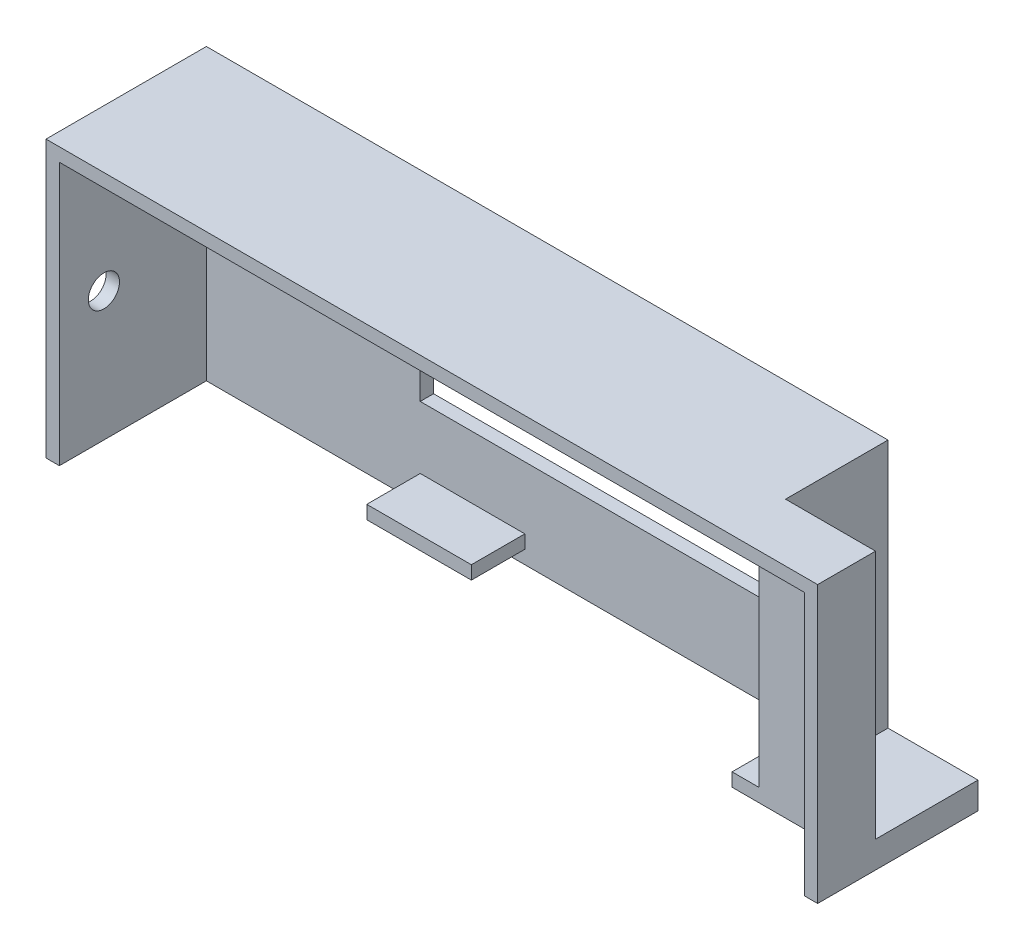
ISO-10303-21;
HEADER;
FILE_DESCRIPTION(('STEP AP214'),'2;1');
FILE_NAME('part.step','',(''),(''),'','','');
FILE_SCHEMA(('AUTOMOTIVE_DESIGN { 1 0 10303 214 1 1 1 1 }'));
ENDSEC;
DATA;
#1=APPLICATION_CONTEXT('core data for automotive mechanical design processes');
#2=APPLICATION_PROTOCOL_DEFINITION('international standard','automotive_design',2000,#1);
#3=PRODUCT_CONTEXT('',#1,'mechanical');
#4=PRODUCT('Part','Part','',(#3));
#5=PRODUCT_RELATED_PRODUCT_CATEGORY('part','',(#4));
#6=PRODUCT_DEFINITION_FORMATION('','',#4);
#7=PRODUCT_DEFINITION_CONTEXT('part definition',#1,'design');
#8=PRODUCT_DEFINITION('design','',#6,#7);
#9=PRODUCT_DEFINITION_SHAPE('','',#8);
#10=(LENGTH_UNIT() NAMED_UNIT(*) SI_UNIT(.MILLI.,.METRE.));
#11=(NAMED_UNIT(*) PLANE_ANGLE_UNIT() SI_UNIT($,.RADIAN.));
#12=(NAMED_UNIT(*) SI_UNIT($,.STERADIAN.) SOLID_ANGLE_UNIT());
#13=UNCERTAINTY_MEASURE_WITH_UNIT(LENGTH_MEASURE(1.E-05),#10,'distance_accuracy_value','');
#14=(GEOMETRIC_REPRESENTATION_CONTEXT(3) GLOBAL_UNCERTAINTY_ASSIGNED_CONTEXT((#13)) GLOBAL_UNIT_ASSIGNED_CONTEXT((#10,
#11,#12)) REPRESENTATION_CONTEXT('',''));
#15=CARTESIAN_POINT('',(0.,0.,0.));
#16=DIRECTION('',(0.,0.,1.));
#17=DIRECTION('',(1.,0.,0.));
#18=AXIS2_PLACEMENT_3D('',#15,#16,#17);
#19=CARTESIAN_POINT('',(-43.2999999999999,31.,-7.4999999999999));
#20=DIRECTION('',(0.,0.,1.));
#21=DIRECTION('',(1.,0.,0.));
#22=AXIS2_PLACEMENT_3D('',#19,#20,#21);
#23=PLANE('',#22);
#24=DIRECTION('',(-1.,0.,0.));
#25=VECTOR('',#24,1.);
#26=CARTESIAN_POINT('',(-17.7999999999999,10.,-7.4999999999999));
#27=LINE('',#26,#25);
#28=CARTESIAN_POINT('',(28.2000000000001,10.,-7.4999999999999));
#29=VERTEX_POINT('',#28);
#30=CARTESIAN_POINT('',(-17.7999999999999,10.,-7.4999999999999));
#31=VERTEX_POINT('',#30);
#32=EDGE_CURVE('E225',#29,#31,#27,.T.);
#33=ORIENTED_EDGE('',*,*,#32,.T.);
#34=DIRECTION('',(0.,1.,0.));
#35=VECTOR('',#34,1.);
#36=CARTESIAN_POINT('',(-17.7999999999999,0.,-7.4999999999999));
#37=LINE('',#36,#35);
#38=CARTESIAN_POINT('',(-17.7999999999999,17.5,-7.4999999999999));
#39=VERTEX_POINT('',#38);
#40=EDGE_CURVE('E59',#31,#39,#37,.T.);
#41=ORIENTED_EDGE('',*,*,#40,.T.);
#42=DIRECTION('',(1.,0.,0.));
#43=VECTOR('',#42,1.);
#44=CARTESIAN_POINT('',(-17.7999999999999,17.5,-7.4999999999999));
#45=LINE('',#44,#43);
#46=CARTESIAN_POINT('',(28.2000000000001,17.5,-7.4999999999999));
#47=VERTEX_POINT('',#46);
#48=EDGE_CURVE('E253',#39,#47,#45,.T.);
#49=ORIENTED_EDGE('',*,*,#48,.T.);
#50=DIRECTION('',(0.,-1.,0.));
#51=VECTOR('',#50,1.);
#52=CARTESIAN_POINT('',(28.2000000000001,0.,-7.4999999999999));
#53=LINE('',#52,#51);
#54=EDGE_CURVE('E235',#47,#29,#53,.T.);
#55=ORIENTED_EDGE('',*,*,#54,.T.);
#56=EDGE_LOOP('',(#33,#41,#49,#55));
#57=FACE_BOUND('',#56,.T.);
#58=DIRECTION('',(0.,-1.,0.));
#59=VECTOR('',#58,1.);
#60=CARTESIAN_POINT('',(-41.7999999999998,31.,-7.4999999999999));
#61=LINE('',#60,#59);
#62=CARTESIAN_POINT('',(-41.7999999999998,29.5,-7.4999999999999));
#63=VERTEX_POINT('',#62);
#64=CARTESIAN_POINT('',(-41.7999999999998,0.,-7.4999999999999));
#65=VERTEX_POINT('',#64);
#66=EDGE_CURVE('E323',#63,#65,#61,.T.);
#67=ORIENTED_EDGE('',*,*,#66,.T.);
#68=DIRECTION('',(-1.,0.,0.));
#69=VECTOR('',#68,1.);
#70=CARTESIAN_POINT('',(-41.7999999999998,0.,-7.4999999999999));
#71=LINE('',#70,#69);
#72=CARTESIAN_POINT('',(41.8000000000001,0.,-7.4999999999999));
#73=VERTEX_POINT('',#72);
#74=EDGE_CURVE('E308',#73,#65,#71,.T.);
#75=ORIENTED_EDGE('',*,*,#74,.F.);
#76=DIRECTION('',(0.,-1.,0.));
#77=VECTOR('',#76,1.);
#78=CARTESIAN_POINT('',(41.8000000000001,18.3055545472877,-7.4999999999999));
#79=LINE('',#78,#77);
#80=CARTESIAN_POINT('',(41.8000000000001,1.5,-7.4999999999999));
#81=VERTEX_POINT('',#80);
#82=EDGE_CURVE('E293',#81,#73,#79,.T.);
#83=ORIENTED_EDGE('',*,*,#82,.F.);
#84=DIRECTION('',(-1.,0.,0.));
#85=VECTOR('',#84,1.);
#86=CARTESIAN_POINT('',(31.7000000000001,1.5,-7.4999999999999));
#87=LINE('',#86,#85);
#88=CARTESIAN_POINT('',(28.7000000000001,1.5,-7.4999999999999));
#89=VERTEX_POINT('',#88);
#90=EDGE_CURVE('E294',#81,#89,#87,.T.);
#91=ORIENTED_EDGE('',*,*,#90,.T.);
#92=DIRECTION('',(0.,-1.,0.));
#93=VECTOR('',#92,1.);
#94=CARTESIAN_POINT('',(28.7000000000001,1.5,-7.4999999999999));
#95=LINE('',#94,#93);
#96=CARTESIAN_POINT('',(28.7000000000001,3.,-7.4999999999999));
#97=VERTEX_POINT('',#96);
#98=EDGE_CURVE('E265',#97,#89,#95,.T.);
#99=ORIENTED_EDGE('',*,*,#98,.F.);
#100=DIRECTION('',(1.,0.,0.));
#101=VECTOR('',#100,1.);
#102=CARTESIAN_POINT('',(28.7000000000001,3.,-7.4999999999999));
#103=LINE('',#102,#101);
#104=CARTESIAN_POINT('',(31.7000000000001,3.,-7.4999999999999));
#105=VERTEX_POINT('',#104);
#106=EDGE_CURVE('E271',#97,#105,#103,.T.);
#107=ORIENTED_EDGE('',*,*,#106,.T.);
#108=DIRECTION('',(0.,1.,0.));
#109=VECTOR('',#108,1.);
#110=CARTESIAN_POINT('',(31.7000000000001,3.,-7.4999999999999));
#111=LINE('',#110,#109);
#112=CARTESIAN_POINT('',(31.7000000000001,29.5,-7.4999999999999));
#113=VERTEX_POINT('',#112);
#114=EDGE_CURVE('E320',#105,#113,#111,.T.);
#115=ORIENTED_EDGE('',*,*,#114,.T.);
#116=DIRECTION('',(-1.,0.,0.));
#117=VECTOR('',#116,1.);
#118=CARTESIAN_POINT('',(-43.2999999999999,29.5,-7.4999999999999));
#119=LINE('',#118,#117);
#120=EDGE_CURVE('E317',#113,#63,#119,.T.);
#121=ORIENTED_EDGE('',*,*,#120,.T.);
#122=EDGE_LOOP('',(#67,#75,#83,#91,#99,#107,#115,#121));
#123=FACE_BOUND('',#122,.T.);
#124=DIRECTION('',(1.,0.,0.));
#125=VECTOR('',#124,1.);
#126=CARTESIAN_POINT('',(-17.7999999999999,1.5,-7.4999999999999));
#127=LINE('',#126,#125);
#128=CARTESIAN_POINT('',(-17.7999999999999,1.5,-7.4999999999999));
#129=VERTEX_POINT('',#128);
#130=CARTESIAN_POINT('',(-6.05959985381203,1.5,-7.4999999999999));
#131=VERTEX_POINT('',#130);
#132=EDGE_CURVE('E613',#129,#131,#127,.T.);
#133=ORIENTED_EDGE('',*,*,#132,.F.);
#134=DIRECTION('',(0.,-1.,0.));
#135=VECTOR('',#134,1.);
#136=CARTESIAN_POINT('',(-17.7999999999999,3.,-7.4999999999999));
#137=LINE('',#136,#135);
#138=CARTESIAN_POINT('',(-17.7999999999999,3.,-7.4999999999999));
#139=VERTEX_POINT('',#138);
#140=EDGE_CURVE('E223',#139,#129,#137,.T.);
#141=ORIENTED_EDGE('',*,*,#140,.F.);
#142=DIRECTION('',(-1.,0.,0.));
#143=VECTOR('',#142,1.);
#144=CARTESIAN_POINT('',(-17.7999999999999,3.,-7.4999999999999));
#145=LINE('',#144,#143);
#146=CARTESIAN_POINT('',(-6.05959985381203,3.,-7.4999999999999));
#147=VERTEX_POINT('',#146);
#148=EDGE_CURVE('E219',#147,#139,#145,.T.);
#149=ORIENTED_EDGE('',*,*,#148,.F.);
#150=DIRECTION('',(0.,1.,0.));
#151=VECTOR('',#150,1.);
#152=CARTESIAN_POINT('',(-6.05959985381203,3.,-7.4999999999999));
#153=LINE('',#152,#151);
#154=EDGE_CURVE('E610',#131,#147,#153,.T.);
#155=ORIENTED_EDGE('',*,*,#154,.F.);
#156=EDGE_LOOP('',(#133,#141,#149,#155));
#157=FACE_BOUND('',#156,.T.);
#158=ADVANCED_FACE('F35',(#57,#123,#157),#23,.T.);
#159=CARTESIAN_POINT('',(31.7000000000001,3.,-8.9999999999999));
#160=DIRECTION('',(-1.,0.,0.));
#161=DIRECTION('',(0.,0.,1.));
#162=AXIS2_PLACEMENT_3D('',#159,#160,#161);
#163=PLANE('',#162);
#164=ORIENTED_EDGE('',*,*,#114,.F.);
#165=DIRECTION('',(0.,0.,-1.));
#166=VECTOR('',#165,1.);
#167=CARTESIAN_POINT('',(31.7000000000001,3.,4.0000000000001));
#168=LINE('',#167,#166);
#169=CARTESIAN_POINT('',(31.7000000000001,3.,4.0000000000001));
#170=VERTEX_POINT('',#169);
#171=EDGE_CURVE('E258',#170,#105,#168,.T.);
#172=ORIENTED_EDGE('',*,*,#171,.F.);
#173=DIRECTION('',(0.,1.,0.));
#174=VECTOR('',#173,1.);
#175=CARTESIAN_POINT('',(31.7000000000001,3.,4.0000000000001));
#176=LINE('',#175,#174);
#177=CARTESIAN_POINT('',(31.7000000000001,29.5,4.0000000000001));
#178=VERTEX_POINT('',#177);
#179=EDGE_CURVE('E314',#170,#178,#176,.T.);
#180=ORIENTED_EDGE('',*,*,#179,.T.);
#181=DIRECTION('',(0.,0.,1.));
#182=VECTOR('',#181,1.);
#183=CARTESIAN_POINT('',(31.7000000000001,29.5,0.));
#184=LINE('',#183,#182);
#185=EDGE_CURVE('E310',#113,#178,#184,.T.);
#186=ORIENTED_EDGE('',*,*,#185,.F.);
#187=EDGE_LOOP('',(#164,#172,#180,#186));
#188=FACE_BOUND('',#187,.T.);
#189=ADVANCED_FACE('F462',(#188),#163,.T.);
#190=CARTESIAN_POINT('',(43.3000000000001,3.,4.0000000000001));
#191=DIRECTION('',(0.,0.,1.));
#192=DIRECTION('',(1.,0.,0.));
#193=AXIS2_PLACEMENT_3D('',#190,#191,#192);
#194=PLANE('',#193);
#195=ORIENTED_EDGE('',*,*,#179,.F.);
#196=DIRECTION('',(1.,0.,0.));
#197=VECTOR('',#196,1.);
#198=CARTESIAN_POINT('',(28.7000000000001,3.,4.0000000000001));
#199=LINE('',#198,#197);
#200=CARTESIAN_POINT('',(28.7000000000001,3.,4.0000000000001));
#201=VERTEX_POINT('',#200);
#202=EDGE_CURVE('E275',#201,#170,#199,.T.);
#203=ORIENTED_EDGE('',*,*,#202,.F.);
#204=DIRECTION('',(0.,1.,0.));
#205=VECTOR('',#204,1.);
#206=CARTESIAN_POINT('',(28.7000000000001,1.5,4.0000000000001));
#207=LINE('',#206,#205);
#208=CARTESIAN_POINT('',(28.7000000000001,1.5,4.0000000000001));
#209=VERTEX_POINT('',#208);
#210=EDGE_CURVE('E259',#209,#201,#207,.T.);
#211=ORIENTED_EDGE('',*,*,#210,.F.);
#212=DIRECTION('',(1.,0.,0.));
#213=VECTOR('',#212,1.);
#214=CARTESIAN_POINT('',(41.8000000000001,1.5,4.0000000000001));
#215=LINE('',#214,#213);
#216=CARTESIAN_POINT('',(41.8000000000001,1.5,4.0000000000001));
#217=VERTEX_POINT('',#216);
#218=EDGE_CURVE('E298',#209,#217,#215,.T.);
#219=ORIENTED_EDGE('',*,*,#218,.T.);
#220=DIRECTION('',(0.,1.,0.));
#221=VECTOR('',#220,1.);
#222=CARTESIAN_POINT('',(41.8000000000001,31.,4.0000000000001));
#223=LINE('',#222,#221);
#224=CARTESIAN_POINT('',(41.8000000000001,29.5,4.0000000000001));
#225=VERTEX_POINT('',#224);
#226=EDGE_CURVE('E311',#217,#225,#223,.T.);
#227=ORIENTED_EDGE('',*,*,#226,.T.);
#228=DIRECTION('',(1.,0.,0.));
#229=VECTOR('',#228,1.);
#230=CARTESIAN_POINT('',(0.,29.5,4.00000000000011));
#231=LINE('',#230,#229);
#232=EDGE_CURVE('E322',#178,#225,#231,.T.);
#233=ORIENTED_EDGE('',*,*,#232,.F.);
#234=EDGE_LOOP('',(#195,#203,#211,#219,#227,#233));
#235=FACE_BOUND('',#234,.T.);
#236=ADVANCED_FACE('F449',(#235),#194,.T.);
#237=CARTESIAN_POINT('',(-43.2999999999998,31.,9.00000000000012));
#238=DIRECTION('',(0.,0.,-1.));
#239=DIRECTION('',(-1.,0.,0.));
#240=AXIS2_PLACEMENT_3D('',#237,#238,#239);
#241=PLANE('',#240);
#242=DIRECTION('',(1.,0.,0.));
#243=VECTOR('',#242,1.);
#244=CARTESIAN_POINT('',(-43.2999999999998,0.,9.00000000000012));
#245=LINE('',#244,#243);
#246=CARTESIAN_POINT('',(-43.2999999999998,0.,9.00000000000012));
#247=VERTEX_POINT('',#246);
#248=CARTESIAN_POINT('',(-41.7999999999998,0.,9.00000000000012));
#249=VERTEX_POINT('',#248);
#250=EDGE_CURVE('E369',#247,#249,#245,.T.);
#251=ORIENTED_EDGE('',*,*,#250,.T.);
#252=DIRECTION('',(0.,-1.,0.));
#253=VECTOR('',#252,1.);
#254=CARTESIAN_POINT('',(-41.7999999999998,31.,9.00000000000012));
#255=LINE('',#254,#253);
#256=CARTESIAN_POINT('',(-41.7999999999998,29.5,9.00000000000012));
#257=VERTEX_POINT('',#256);
#258=EDGE_CURVE('E327',#257,#249,#255,.T.);
#259=ORIENTED_EDGE('',*,*,#258,.F.);
#260=DIRECTION('',(1.,0.,0.));
#261=VECTOR('',#260,1.);
#262=CARTESIAN_POINT('',(-43.2999999999998,29.5,9.00000000000012));
#263=LINE('',#262,#261);
#264=CARTESIAN_POINT('',(41.8000000000001,29.5,9.00000000000012));
#265=VERTEX_POINT('',#264);
#266=EDGE_CURVE('E330',#257,#265,#263,.T.);
#267=ORIENTED_EDGE('',*,*,#266,.T.);
#268=DIRECTION('',(0.,-1.,0.));
#269=VECTOR('',#268,1.);
#270=CARTESIAN_POINT('',(41.8000000000001,31.,9.00000000000012));
#271=LINE('',#270,#269);
#272=CARTESIAN_POINT('',(41.8000000000001,0.,9.00000000000012));
#273=VERTEX_POINT('',#272);
#274=EDGE_CURVE('E336',#265,#273,#271,.T.);
#275=ORIENTED_EDGE('',*,*,#274,.T.);
#276=CARTESIAN_POINT('',(43.3000000000001,0.,9.00000000000012));
#277=VERTEX_POINT('',#276);
#278=EDGE_CURVE('E382',#273,#277,#245,.T.);
#279=ORIENTED_EDGE('',*,*,#278,.T.);
#280=DIRECTION('',(0.,-1.,0.));
#281=VECTOR('',#280,1.);
#282=CARTESIAN_POINT('',(43.3000000000001,31.,9.00000000000012));
#283=LINE('',#282,#281);
#284=CARTESIAN_POINT('',(43.3000000000001,31.,9.00000000000012));
#285=VERTEX_POINT('',#284);
#286=EDGE_CURVE('E375',#285,#277,#283,.T.);
#287=ORIENTED_EDGE('',*,*,#286,.F.);
#288=DIRECTION('',(1.,0.,0.));
#289=VECTOR('',#288,1.);
#290=CARTESIAN_POINT('',(-43.2999999999998,31.,9.00000000000012));
#291=LINE('',#290,#289);
#292=CARTESIAN_POINT('',(-43.2999999999998,31.,9.00000000000012));
#293=VERTEX_POINT('',#292);
#294=EDGE_CURVE('E373',#293,#285,#291,.T.);
#295=ORIENTED_EDGE('',*,*,#294,.F.);
#296=DIRECTION('',(0.,-1.,0.));
#297=VECTOR('',#296,1.);
#298=CARTESIAN_POINT('',(-43.2999999999998,31.,9.00000000000012));
#299=LINE('',#298,#297);
#300=EDGE_CURVE('E387',#293,#247,#299,.T.);
#301=ORIENTED_EDGE('',*,*,#300,.T.);
#302=EDGE_LOOP('',(#251,#259,#267,#275,#279,#287,#295,#301));
#303=FACE_BOUND('',#302,.T.);
#304=ADVANCED_FACE('F407',(#303),#241,.F.);
#305=CARTESIAN_POINT('',(43.3000000000001,31.,-8.9999999999999));
#306=DIRECTION('',(-1.,0.,0.));
#307=DIRECTION('',(0.,0.,1.));
#308=AXIS2_PLACEMENT_3D('',#305,#306,#307);
#309=PLANE('',#308);
#310=DIRECTION('',(0.,0.,-1.));
#311=VECTOR('',#310,1.);
#312=CARTESIAN_POINT('',(43.3000000000001,3.,-8.9999999999999));
#313=LINE('',#312,#311);
#314=CARTESIAN_POINT('',(43.3000000000001,3.,2.5000000000001));
#315=VERTEX_POINT('',#314);
#316=CARTESIAN_POINT('',(43.3000000000001,3.,-8.9999999999999));
#317=VERTEX_POINT('',#316);
#318=EDGE_CURVE('E341',#315,#317,#313,.T.);
#319=ORIENTED_EDGE('',*,*,#318,.F.);
#320=DIRECTION('',(0.,1.,0.));
#321=VECTOR('',#320,1.);
#322=CARTESIAN_POINT('',(43.3000000000001,3.,2.5000000000001));
#323=LINE('',#322,#321);
#324=CARTESIAN_POINT('',(43.3000000000001,31.,2.5000000000001));
#325=VERTEX_POINT('',#324);
#326=EDGE_CURVE('E357',#315,#325,#323,.T.);
#327=ORIENTED_EDGE('',*,*,#326,.T.);
#328=DIRECTION('',(0.,0.,-1.));
#329=VECTOR('',#328,1.);
#330=CARTESIAN_POINT('',(43.3000000000001,31.,-8.9999999999999));
#331=LINE('',#330,#329);
#332=EDGE_CURVE('E365',#285,#325,#331,.T.);
#333=ORIENTED_EDGE('',*,*,#332,.F.);
#334=ORIENTED_EDGE('',*,*,#286,.T.);
#335=DIRECTION('',(0.,0.,-1.));
#336=VECTOR('',#335,1.);
#337=CARTESIAN_POINT('',(43.3000000000001,0.,-8.9999999999999));
#338=LINE('',#337,#336);
#339=CARTESIAN_POINT('',(43.3000000000001,0.,-8.9999999999999));
#340=VERTEX_POINT('',#339);
#341=EDGE_CURVE('E360',#277,#340,#338,.T.);
#342=ORIENTED_EDGE('',*,*,#341,.T.);
#343=DIRECTION('',(0.,-1.,0.));
#344=VECTOR('',#343,1.);
#345=CARTESIAN_POINT('',(43.3000000000001,31.,-8.9999999999999));
#346=LINE('',#345,#344);
#347=EDGE_CURVE('E12',#317,#340,#346,.T.);
#348=ORIENTED_EDGE('',*,*,#347,.F.);
#349=EDGE_LOOP('',(#319,#327,#333,#334,#342,#348));
#350=FACE_BOUND('',#349,.T.);
#351=ADVANCED_FACE('F37',(#350),#309,.F.);
#352=CARTESIAN_POINT('',(-43.2999999999999,31.,-8.9999999999999));
#353=DIRECTION('',(0.,0.,1.));
#354=DIRECTION('',(1.,0.,0.));
#355=AXIS2_PLACEMENT_3D('',#352,#353,#354);
#356=PLANE('',#355);
#357=DIRECTION('',(0.,1.,0.));
#358=VECTOR('',#357,1.);
#359=CARTESIAN_POINT('',(-17.7999999999999,0.,-8.9999999999999));
#360=LINE('',#359,#358);
#361=CARTESIAN_POINT('',(-17.7999999999999,10.,-8.9999999999999));
#362=VERTEX_POINT('',#361);
#363=CARTESIAN_POINT('',(-17.7999999999999,17.5,-8.9999999999999));
#364=VERTEX_POINT('',#363);
#365=EDGE_CURVE('E243',#362,#364,#360,.T.);
#366=ORIENTED_EDGE('',*,*,#365,.F.);
#367=DIRECTION('',(1.,0.,0.));
#368=VECTOR('',#367,1.);
#369=CARTESIAN_POINT('',(-17.7999999999999,10.,-8.9999999999999));
#370=LINE('',#369,#368);
#371=CARTESIAN_POINT('',(28.2000000000001,10.,-8.9999999999999));
#372=VERTEX_POINT('',#371);
#373=EDGE_CURVE('E233',#362,#372,#370,.T.);
#374=ORIENTED_EDGE('',*,*,#373,.T.);
#375=DIRECTION('',(0.,-1.,0.));
#376=VECTOR('',#375,1.);
#377=CARTESIAN_POINT('',(28.2000000000001,0.,-8.9999999999999));
#378=LINE('',#377,#376);
#379=CARTESIAN_POINT('',(28.2000000000001,17.5,-8.9999999999999));
#380=VERTEX_POINT('',#379);
#381=EDGE_CURVE('E248',#380,#372,#378,.T.);
#382=ORIENTED_EDGE('',*,*,#381,.F.);
#383=DIRECTION('',(1.,0.,0.));
#384=VECTOR('',#383,1.);
#385=CARTESIAN_POINT('',(-17.7999999999999,17.5,-8.9999999999999));
#386=LINE('',#385,#384);
#387=EDGE_CURVE('E245',#364,#380,#386,.T.);
#388=ORIENTED_EDGE('',*,*,#387,.F.);
#389=EDGE_LOOP('',(#366,#374,#382,#388));
#390=FACE_BOUND('',#389,.T.);
#391=DIRECTION('',(-1.,0.,0.));
#392=VECTOR('',#391,1.);
#393=CARTESIAN_POINT('',(-43.2999999999999,0.,-8.9999999999999));
#394=LINE('',#393,#392);
#395=CARTESIAN_POINT('',(-43.2999999999999,0.,-8.9999999999999));
#396=VERTEX_POINT('',#395);
#397=EDGE_CURVE('E378',#340,#396,#394,.T.);
#398=ORIENTED_EDGE('',*,*,#397,.T.);
#399=DIRECTION('',(0.,-1.,0.));
#400=VECTOR('',#399,1.);
#401=CARTESIAN_POINT('',(-43.2999999999999,31.,-8.9999999999999));
#402=LINE('',#401,#400);
#403=CARTESIAN_POINT('',(-43.2999999999999,31.,-8.9999999999999));
#404=VERTEX_POINT('',#403);
#405=EDGE_CURVE('E44',#404,#396,#402,.T.);
#406=ORIENTED_EDGE('',*,*,#405,.F.);
#407=DIRECTION('',(-1.,0.,0.));
#408=VECTOR('',#407,1.);
#409=CARTESIAN_POINT('',(-43.2999999999999,31.,-8.9999999999999));
#410=LINE('',#409,#408);
#411=CARTESIAN_POINT('',(33.2000000000001,31.,-8.9999999999999));
#412=VERTEX_POINT('',#411);
#413=EDGE_CURVE('E368',#412,#404,#410,.T.);
#414=ORIENTED_EDGE('',*,*,#413,.F.);
#415=DIRECTION('',(0.,1.,0.));
#416=VECTOR('',#415,1.);
#417=CARTESIAN_POINT('',(33.2000000000001,3.,-8.9999999999999));
#418=LINE('',#417,#416);
#419=CARTESIAN_POINT('',(33.2000000000001,3.,-8.9999999999999));
#420=VERTEX_POINT('',#419);
#421=EDGE_CURVE('E354',#420,#412,#418,.T.);
#422=ORIENTED_EDGE('',*,*,#421,.F.);
#423=DIRECTION('',(-1.,0.,0.));
#424=VECTOR('',#423,1.);
#425=CARTESIAN_POINT('',(43.3000000000001,3.,-8.9999999999999));
#426=LINE('',#425,#424);
#427=EDGE_CURVE('E343',#317,#420,#426,.T.);
#428=ORIENTED_EDGE('',*,*,#427,.F.);
#429=ORIENTED_EDGE('',*,*,#347,.T.);
#430=EDGE_LOOP('',(#398,#406,#414,#422,#428,#429));
#431=FACE_BOUND('',#430,.T.);
#432=ADVANCED_FACE('F416',(#390,#431),#356,.F.);
#433=CARTESIAN_POINT('',(-43.2999999999999,31.,-8.9999999999999));
#434=DIRECTION('',(1.,0.,0.));
#435=DIRECTION('',(0.,0.,-1.));
#436=AXIS2_PLACEMENT_3D('',#433,#434,#435);
#437=PLANE('',#436);
#438=CARTESIAN_POINT('',(-43.2999999999999,26.,0.500000000000102));
#439=DIRECTION('',(-1.,0.,0.));
#440=DIRECTION('',(0.,0.,1.));
#441=AXIS2_PLACEMENT_3D('',#438,#439,#440);
#442=CIRCLE('',#441,2.25);
#443=CARTESIAN_POINT('',(-43.2999999999999,26.,2.7500000000001));
#444=VERTEX_POINT('',#443);
#445=EDGE_CURVE('E278',#444,#444,#442,.T.);
#446=ORIENTED_EDGE('',*,*,#445,.F.);
#447=EDGE_LOOP('',(#446));
#448=FACE_BOUND('',#447,.T.);
#449=CARTESIAN_POINT('',(-43.2999999999999,14.5,4.0000000000001));
#450=DIRECTION('',(-1.,0.,0.));
#451=DIRECTION('',(0.,0.,1.));
#452=AXIS2_PLACEMENT_3D('',#449,#450,#451);
#453=CIRCLE('',#452,1.75);
#454=CARTESIAN_POINT('',(-43.2999999999999,14.5,5.7500000000001));
#455=VERTEX_POINT('',#454);
#456=EDGE_CURVE('E285',#455,#455,#453,.T.);
#457=ORIENTED_EDGE('',*,*,#456,.F.);
#458=EDGE_LOOP('',(#457));
#459=FACE_BOUND('',#458,.T.);
#460=DIRECTION('',(0.,0.,1.));
#461=VECTOR('',#460,1.);
#462=CARTESIAN_POINT('',(-43.2999999999999,0.,-8.9999999999999));
#463=LINE('',#462,#461);
#464=EDGE_CURVE('E380',#396,#247,#463,.T.);
#465=ORIENTED_EDGE('',*,*,#464,.T.);
#466=ORIENTED_EDGE('',*,*,#300,.F.);
#467=DIRECTION('',(0.,0.,1.));
#468=VECTOR('',#467,1.);
#469=CARTESIAN_POINT('',(-43.2999999999999,31.,-8.9999999999999));
#470=LINE('',#469,#468);
#471=EDGE_CURVE('E371',#404,#293,#470,.T.);
#472=ORIENTED_EDGE('',*,*,#471,.F.);
#473=ORIENTED_EDGE('',*,*,#405,.T.);
#474=EDGE_LOOP('',(#465,#466,#472,#473));
#475=FACE_BOUND('',#474,.T.);
#476=ADVANCED_FACE('F395',(#448,#459,#475),#437,.F.);
#477=CARTESIAN_POINT('',(0.,31.,0.));
#478=DIRECTION('',(0.,1.,0.));
#479=DIRECTION('',(0.,0.,1.));
#480=AXIS2_PLACEMENT_3D('',#477,#478,#479);
#481=PLANE('',#480);
#482=DIRECTION('',(1.,0.,0.));
#483=VECTOR('',#482,1.);
#484=CARTESIAN_POINT('',(43.3000000000001,31.,2.5000000000001));
#485=LINE('',#484,#483);
#486=CARTESIAN_POINT('',(33.2000000000001,31.,2.5000000000001));
#487=VERTEX_POINT('',#486);
#488=EDGE_CURVE('E344',#487,#325,#485,.T.);
#489=ORIENTED_EDGE('',*,*,#488,.F.);
#490=DIRECTION('',(0.,0.,1.));
#491=VECTOR('',#490,1.);
#492=CARTESIAN_POINT('',(33.2000000000001,31.,-8.9999999999999));
#493=LINE('',#492,#491);
#494=EDGE_CURVE('E326',#412,#487,#493,.T.);
#495=ORIENTED_EDGE('',*,*,#494,.F.);
#496=ORIENTED_EDGE('',*,*,#413,.T.);
#497=ORIENTED_EDGE('',*,*,#471,.T.);
#498=ORIENTED_EDGE('',*,*,#294,.T.);
#499=ORIENTED_EDGE('',*,*,#332,.T.);
#500=EDGE_LOOP('',(#489,#495,#496,#497,#498,#499));
#501=FACE_BOUND('',#500,.T.);
#502=ADVANCED_FACE('F413',(#501),#481,.T.);
#503=CARTESIAN_POINT('',(0.,0.,0.));
#504=DIRECTION('',(0.,1.,0.));
#505=DIRECTION('',(0.,0.,1.));
#506=AXIS2_PLACEMENT_3D('',#503,#504,#505);
#507=PLANE('',#506);
#508=ORIENTED_EDGE('',*,*,#74,.T.);
#509=DIRECTION('',(0.,0.,1.));
#510=VECTOR('',#509,1.);
#511=CARTESIAN_POINT('',(-41.7999999999998,0.,9.00000000000012));
#512=LINE('',#511,#510);
#513=EDGE_CURVE('E303',#65,#249,#512,.T.);
#514=ORIENTED_EDGE('',*,*,#513,.T.);
#515=ORIENTED_EDGE('',*,*,#250,.F.);
#516=ORIENTED_EDGE('',*,*,#464,.F.);
#517=ORIENTED_EDGE('',*,*,#397,.F.);
#518=ORIENTED_EDGE('',*,*,#341,.F.);
#519=ORIENTED_EDGE('',*,*,#278,.F.);
#520=DIRECTION('',(0.,0.,-1.));
#521=VECTOR('',#520,1.);
#522=CARTESIAN_POINT('',(41.8000000000001,0.,4.0000000000001));
#523=LINE('',#522,#521);
#524=EDGE_CURVE('E306',#273,#73,#523,.T.);
#525=ORIENTED_EDGE('',*,*,#524,.T.);
#526=EDGE_LOOP('',(#508,#514,#515,#516,#517,#518,#519,#525));
#527=FACE_BOUND('',#526,.T.);
#528=ADVANCED_FACE('F402',(#527),#507,.F.);
#529=CARTESIAN_POINT('',(43.3000000000001,3.,2.5000000000001));
#530=DIRECTION('',(0.,0.,1.));
#531=DIRECTION('',(1.,0.,0.));
#532=AXIS2_PLACEMENT_3D('',#529,#530,#531);
#533=PLANE('',#532);
#534=ORIENTED_EDGE('',*,*,#488,.T.);
#535=ORIENTED_EDGE('',*,*,#326,.F.);
#536=DIRECTION('',(1.,0.,0.));
#537=VECTOR('',#536,1.);
#538=CARTESIAN_POINT('',(43.3000000000001,3.,2.5000000000001));
#539=LINE('',#538,#537);
#540=CARTESIAN_POINT('',(33.2000000000001,3.,2.5000000000001));
#541=VERTEX_POINT('',#540);
#542=EDGE_CURVE('E351',#541,#315,#539,.T.);
#543=ORIENTED_EDGE('',*,*,#542,.F.);
#544=DIRECTION('',(0.,1.,0.));
#545=VECTOR('',#544,1.);
#546=CARTESIAN_POINT('',(33.2000000000001,3.,2.5000000000001));
#547=LINE('',#546,#545);
#548=EDGE_CURVE('E361',#541,#487,#547,.T.);
#549=ORIENTED_EDGE('',*,*,#548,.T.);
#550=EDGE_LOOP('',(#534,#535,#543,#549));
#551=FACE_BOUND('',#550,.T.);
#552=ADVANCED_FACE('F495',(#551),#533,.F.);
#553=CARTESIAN_POINT('',(33.2000000000001,3.,-8.9999999999999));
#554=DIRECTION('',(-1.,0.,0.));
#555=DIRECTION('',(0.,0.,1.));
#556=AXIS2_PLACEMENT_3D('',#553,#554,#555);
#557=PLANE('',#556);
#558=DIRECTION('',(0.,0.,1.));
#559=VECTOR('',#558,1.);
#560=CARTESIAN_POINT('',(33.2000000000001,3.,-8.9999999999999));
#561=LINE('',#560,#559);
#562=CARTESIAN_POINT('',(33.2000000000001,3.,-0.499999999999896));
#563=VERTEX_POINT('',#562);
#564=EDGE_CURVE('E347',#563,#541,#561,.T.);
#565=ORIENTED_EDGE('',*,*,#564,.F.);
#566=EDGE_CURVE('E348',#420,#563,#561,.T.);
#567=ORIENTED_EDGE('',*,*,#566,.F.);
#568=ORIENTED_EDGE('',*,*,#421,.T.);
#569=ORIENTED_EDGE('',*,*,#494,.T.);
#570=ORIENTED_EDGE('',*,*,#548,.F.);
#571=EDGE_LOOP('',(#565,#567,#568,#569,#570));
#572=FACE_BOUND('',#571,.T.);
#573=ADVANCED_FACE('F421',(#572),#557,.F.);
#574=CARTESIAN_POINT('',(0.,3.,0.));
#575=DIRECTION('',(0.,-1.,0.));
#576=DIRECTION('',(0.,0.,-1.));
#577=AXIS2_PLACEMENT_3D('',#574,#575,#576);
#578=PLANE('',#577);
#579=ORIENTED_EDGE('',*,*,#566,.T.);
#580=CARTESIAN_POINT('',(35.2000000000001,3.,-0.499999999999896));
#581=DIRECTION('',(0.,-1.,0.));
#582=DIRECTION('',(0.,0.,-1.));
#583=AXIS2_PLACEMENT_3D('',#580,#581,#582);
#584=CIRCLE('',#583,2.);
#585=EDGE_CURVE('E290',#563,#563,#584,.T.);
#586=ORIENTED_EDGE('',*,*,#585,.T.);
#587=ORIENTED_EDGE('',*,*,#564,.T.);
#588=ORIENTED_EDGE('',*,*,#542,.T.);
#589=ORIENTED_EDGE('',*,*,#318,.T.);
#590=ORIENTED_EDGE('',*,*,#427,.T.);
#591=EDGE_LOOP('',(#579,#586,#587,#588,#589,#590));
#592=FACE_BOUND('',#591,.T.);
#593=ADVANCED_FACE('F424',(#592),#578,.F.);
#594=CARTESIAN_POINT('',(41.8000000000001,31.,-8.9999999999999));
#595=DIRECTION('',(-1.,0.,0.));
#596=DIRECTION('',(0.,0.,1.));
#597=AXIS2_PLACEMENT_3D('',#594,#595,#596);
#598=PLANE('',#597);
#599=ORIENTED_EDGE('',*,*,#226,.F.);
#600=DIRECTION('',(0.,0.,-1.));
#601=VECTOR('',#600,1.);
#602=CARTESIAN_POINT('',(41.8000000000001,1.5,-7.4999999999999));
#603=LINE('',#602,#601);
#604=EDGE_CURVE('E296',#217,#81,#603,.T.);
#605=ORIENTED_EDGE('',*,*,#604,.T.);
#606=ORIENTED_EDGE('',*,*,#82,.T.);
#607=ORIENTED_EDGE('',*,*,#524,.F.);
#608=ORIENTED_EDGE('',*,*,#274,.F.);
#609=DIRECTION('',(0.,0.,-1.));
#610=VECTOR('',#609,1.);
#611=CARTESIAN_POINT('',(41.8000000000001,29.5,-8.9999999999999));
#612=LINE('',#611,#610);
#613=EDGE_CURVE('E313',#265,#225,#612,.T.);
#614=ORIENTED_EDGE('',*,*,#613,.T.);
#615=EDGE_LOOP('',(#599,#605,#606,#607,#608,#614));
#616=FACE_BOUND('',#615,.T.);
#617=ADVANCED_FACE('F434',(#616),#598,.T.);
#618=CARTESIAN_POINT('',(-41.7999999999998,31.,-8.9999999999999));
#619=DIRECTION('',(1.,0.,0.));
#620=DIRECTION('',(0.,0.,-1.));
#621=AXIS2_PLACEMENT_3D('',#618,#619,#620);
#622=PLANE('',#621);
#623=CARTESIAN_POINT('',(-41.7999999999998,26.,0.500000000000102));
#624=DIRECTION('',(1.,0.,0.));
#625=DIRECTION('',(0.,0.,-1.));
#626=AXIS2_PLACEMENT_3D('',#623,#624,#625);
#627=CIRCLE('',#626,2.25);
#628=CARTESIAN_POINT('',(-41.7999999999998,26.,-1.7499999999999));
#629=VERTEX_POINT('',#628);
#630=EDGE_CURVE('E279',#629,#629,#627,.F.);
#631=ORIENTED_EDGE('',*,*,#630,.T.);
#632=EDGE_LOOP('',(#631));
#633=FACE_BOUND('',#632,.T.);
#634=CARTESIAN_POINT('',(-41.7999999999998,14.5,4.0000000000001));
#635=DIRECTION('',(1.,0.,0.));
#636=DIRECTION('',(0.,0.,-1.));
#637=AXIS2_PLACEMENT_3D('',#634,#635,#636);
#638=CIRCLE('',#637,1.75);
#639=CARTESIAN_POINT('',(-41.7999999999998,14.5,2.2500000000001));
#640=VERTEX_POINT('',#639);
#641=EDGE_CURVE('E282',#640,#640,#638,.F.);
#642=ORIENTED_EDGE('',*,*,#641,.T.);
#643=EDGE_LOOP('',(#642));
#644=FACE_BOUND('',#643,.T.);
#645=ORIENTED_EDGE('',*,*,#258,.T.);
#646=ORIENTED_EDGE('',*,*,#513,.F.);
#647=ORIENTED_EDGE('',*,*,#66,.F.);
#648=DIRECTION('',(0.,0.,1.));
#649=VECTOR('',#648,1.);
#650=CARTESIAN_POINT('',(-41.7999999999998,29.5,-8.9999999999999));
#651=LINE('',#650,#649);
#652=EDGE_CURVE('E319',#63,#257,#651,.T.);
#653=ORIENTED_EDGE('',*,*,#652,.T.);
#654=EDGE_LOOP('',(#645,#646,#647,#653));
#655=FACE_BOUND('',#654,.T.);
#656=ADVANCED_FACE('F443',(#633,#644,#655),#622,.T.);
#657=CARTESIAN_POINT('',(0.,29.5,0.));
#658=DIRECTION('',(0.,1.,0.));
#659=DIRECTION('',(0.,0.,1.));
#660=AXIS2_PLACEMENT_3D('',#657,#658,#659);
#661=PLANE('',#660);
#662=ORIENTED_EDGE('',*,*,#232,.T.);
#663=ORIENTED_EDGE('',*,*,#613,.F.);
#664=ORIENTED_EDGE('',*,*,#266,.F.);
#665=ORIENTED_EDGE('',*,*,#652,.F.);
#666=ORIENTED_EDGE('',*,*,#120,.F.);
#667=ORIENTED_EDGE('',*,*,#185,.T.);
#668=EDGE_LOOP('',(#662,#663,#664,#665,#666,#667));
#669=FACE_BOUND('',#668,.T.);
#670=ADVANCED_FACE('F445',(#669),#661,.F.);
#671=CARTESIAN_POINT('',(0.,1.5,0.));
#672=DIRECTION('',(0.,-1.,0.));
#673=DIRECTION('',(0.,0.,-1.));
#674=AXIS2_PLACEMENT_3D('',#671,#672,#673);
#675=PLANE('',#674);
#676=CARTESIAN_POINT('',(35.2000000000001,1.5,-0.499999999999896));
#677=DIRECTION('',(0.,-1.,0.));
#678=DIRECTION('',(0.,0.,-1.));
#679=AXIS2_PLACEMENT_3D('',#676,#677,#678);
#680=CIRCLE('',#679,2.);
#681=CARTESIAN_POINT('',(35.2000000000001,1.5,-2.4999999999999));
#682=VERTEX_POINT('',#681);
#683=EDGE_CURVE('E39',#682,#682,#680,.T.);
#684=ORIENTED_EDGE('',*,*,#683,.F.);
#685=EDGE_LOOP('',(#684));
#686=FACE_BOUND('',#685,.T.);
#687=ORIENTED_EDGE('',*,*,#604,.F.);
#688=ORIENTED_EDGE('',*,*,#218,.F.);
#689=DIRECTION('',(0.,0.,1.));
#690=VECTOR('',#689,1.);
#691=CARTESIAN_POINT('',(28.7000000000001,1.5,4.0000000000001));
#692=LINE('',#691,#690);
#693=EDGE_CURVE('E268',#89,#209,#692,.T.);
#694=ORIENTED_EDGE('',*,*,#693,.F.);
#695=ORIENTED_EDGE('',*,*,#90,.F.);
#696=EDGE_LOOP('',(#687,#688,#694,#695));
#697=FACE_BOUND('',#696,.T.);
#698=ADVANCED_FACE('F454',(#686,#697),#675,.T.);
#699=CARTESIAN_POINT('',(35.2000000000001,0.,-0.499999999999896));
#700=DIRECTION('',(0.,1.,0.));
#701=DIRECTION('',(0.,0.,1.));
#702=AXIS2_PLACEMENT_3D('',#699,#700,#701);
#703=CYLINDRICAL_SURFACE('',#702,2.);
#704=ORIENTED_EDGE('',*,*,#683,.T.);
#705=EDGE_LOOP('',(#704));
#706=FACE_BOUND('',#705,.T.);
#707=ORIENTED_EDGE('',*,*,#585,.F.);
#708=EDGE_LOOP('',(#707));
#709=FACE_BOUND('',#708,.T.);
#710=ADVANCED_FACE('F659',(#706,#709),#703,.F.);
#711=CARTESIAN_POINT('',(43.3010000000001,14.5,4.00000000000007));
#712=DIRECTION('',(-1.,0.,0.));
#713=DIRECTION('',(0.,0.,1.));
#714=AXIS2_PLACEMENT_3D('',#711,#712,#713);
#715=CYLINDRICAL_SURFACE('',#714,1.75);
#716=ORIENTED_EDGE('',*,*,#641,.F.);
#717=EDGE_LOOP('',(#716));
#718=FACE_BOUND('',#717,.T.);
#719=ORIENTED_EDGE('',*,*,#456,.T.);
#720=EDGE_LOOP('',(#719));
#721=FACE_BOUND('',#720,.T.);
#722=ADVANCED_FACE('F473',(#718,#721),#715,.F.);
#723=CARTESIAN_POINT('',(43.3010000000001,26.,0.500000000000069));
#724=DIRECTION('',(-1.,0.,0.));
#725=DIRECTION('',(0.,0.,1.));
#726=AXIS2_PLACEMENT_3D('',#723,#724,#725);
#727=CYLINDRICAL_SURFACE('',#726,2.25);
#728=ORIENTED_EDGE('',*,*,#630,.F.);
#729=EDGE_LOOP('',(#728));
#730=FACE_BOUND('',#729,.T.);
#731=ORIENTED_EDGE('',*,*,#445,.T.);
#732=EDGE_LOOP('',(#731));
#733=FACE_BOUND('',#732,.T.);
#734=ADVANCED_FACE('F465',(#730,#733),#727,.F.);
#735=CARTESIAN_POINT('',(28.7000000000001,3.,4.0000000000001));
#736=DIRECTION('',(0.,-1.,0.));
#737=DIRECTION('',(0.,0.,-1.));
#738=AXIS2_PLACEMENT_3D('',#735,#736,#737);
#739=PLANE('',#738);
#740=ORIENTED_EDGE('',*,*,#171,.T.);
#741=ORIENTED_EDGE('',*,*,#106,.F.);
#742=DIRECTION('',(0.,0.,-1.));
#743=VECTOR('',#742,1.);
#744=CARTESIAN_POINT('',(28.7000000000001,3.,4.0000000000001));
#745=LINE('',#744,#743);
#746=EDGE_CURVE('E262',#201,#97,#745,.T.);
#747=ORIENTED_EDGE('',*,*,#746,.F.);
#748=ORIENTED_EDGE('',*,*,#202,.T.);
#749=EDGE_LOOP('',(#740,#741,#747,#748));
#750=FACE_BOUND('',#749,.T.);
#751=ADVANCED_FACE('F463',(#750),#739,.F.);
#752=CARTESIAN_POINT('',(28.7000000000001,0.,0.));
#753=DIRECTION('',(-1.,0.,0.));
#754=DIRECTION('',(0.,0.,1.));
#755=AXIS2_PLACEMENT_3D('',#752,#753,#754);
#756=PLANE('',#755);
#757=ORIENTED_EDGE('',*,*,#210,.T.);
#758=ORIENTED_EDGE('',*,*,#746,.T.);
#759=ORIENTED_EDGE('',*,*,#98,.T.);
#760=ORIENTED_EDGE('',*,*,#693,.T.);
#761=EDGE_LOOP('',(#757,#758,#759,#760));
#762=FACE_BOUND('',#761,.T.);
#763=ADVANCED_FACE('F456',(#762),#756,.T.);
#764=CARTESIAN_POINT('',(-17.7999999999999,0.,9.00100000000012));
#765=DIRECTION('',(-1.,0.,0.));
#766=DIRECTION('',(0.,-1.,0.));
#767=AXIS2_PLACEMENT_3D('',#764,#765,#766);
#768=PLANE('',#767);
#769=ORIENTED_EDGE('',*,*,#40,.F.);
#770=DIRECTION('',(0.,0.,1.));
#771=VECTOR('',#770,1.);
#772=CARTESIAN_POINT('',(-17.7999999999999,10.,-56.0744091837592));
#773=LINE('',#772,#771);
#774=EDGE_CURVE('E236',#362,#31,#773,.T.);
#775=ORIENTED_EDGE('',*,*,#774,.F.);
#776=ORIENTED_EDGE('',*,*,#365,.T.);
#777=DIRECTION('',(0.,0.,-1.));
#778=VECTOR('',#777,1.);
#779=CARTESIAN_POINT('',(-17.7999999999999,17.5,9.00100000000012));
#780=LINE('',#779,#778);
#781=EDGE_CURVE('E250',#39,#364,#780,.T.);
#782=ORIENTED_EDGE('',*,*,#781,.F.);
#783=EDGE_LOOP('',(#769,#775,#776,#782));
#784=FACE_BOUND('',#783,.T.);
#785=ADVANCED_FACE('F471',(#784),#768,.F.);
#786=CARTESIAN_POINT('',(28.2000000000001,0.,9.00100000000012));
#787=DIRECTION('',(1.,0.,0.));
#788=DIRECTION('',(0.,0.,-1.));
#789=AXIS2_PLACEMENT_3D('',#786,#787,#788);
#790=PLANE('',#789);
#791=ORIENTED_EDGE('',*,*,#381,.T.);
#792=DIRECTION('',(0.,0.,1.));
#793=VECTOR('',#792,1.);
#794=CARTESIAN_POINT('',(28.2000000000001,10.,-56.0744091837592));
#795=LINE('',#794,#793);
#796=EDGE_CURVE('E228',#372,#29,#795,.T.);
#797=ORIENTED_EDGE('',*,*,#796,.T.);
#798=ORIENTED_EDGE('',*,*,#54,.F.);
#799=DIRECTION('',(0.,0.,-1.));
#800=VECTOR('',#799,1.);
#801=CARTESIAN_POINT('',(28.2000000000001,17.5,9.00100000000012));
#802=LINE('',#801,#800);
#803=EDGE_CURVE('E251',#47,#380,#802,.T.);
#804=ORIENTED_EDGE('',*,*,#803,.T.);
#805=EDGE_LOOP('',(#791,#797,#798,#804));
#806=FACE_BOUND('',#805,.T.);
#807=ADVANCED_FACE('F522',(#806),#790,.F.);
#808=CARTESIAN_POINT('',(-17.7999999999999,17.5,9.00100000000012));
#809=DIRECTION('',(0.,1.,0.));
#810=DIRECTION('',(-1.,0.,0.));
#811=AXIS2_PLACEMENT_3D('',#808,#809,#810);
#812=PLANE('',#811);
#813=ORIENTED_EDGE('',*,*,#781,.T.);
#814=ORIENTED_EDGE('',*,*,#387,.T.);
#815=ORIENTED_EDGE('',*,*,#803,.F.);
#816=ORIENTED_EDGE('',*,*,#48,.F.);
#817=EDGE_LOOP('',(#813,#814,#815,#816));
#818=FACE_BOUND('',#817,.T.);
#819=ADVANCED_FACE('F526',(#818),#812,.F.);
#820=CARTESIAN_POINT('',(-17.7999999999999,10.,-56.0744091837592));
#821=DIRECTION('',(0.,1.,0.));
#822=DIRECTION('',(0.,0.,1.));
#823=AXIS2_PLACEMENT_3D('',#820,#821,#822);
#824=PLANE('',#823);
#825=ORIENTED_EDGE('',*,*,#373,.F.);
#826=ORIENTED_EDGE('',*,*,#774,.T.);
#827=ORIENTED_EDGE('',*,*,#32,.F.);
#828=ORIENTED_EDGE('',*,*,#796,.F.);
#829=EDGE_LOOP('',(#825,#826,#827,#828));
#830=FACE_BOUND('',#829,.T.);
#831=ADVANCED_FACE('F520',(#830),#824,.T.);
#832=CARTESIAN_POINT('',(-17.7999999999999,3.,-1.4999999999999));
#833=DIRECTION('',(1.,0.,0.));
#834=DIRECTION('',(0.,0.,-1.));
#835=AXIS2_PLACEMENT_3D('',#832,#833,#834);
#836=PLANE('',#835);
#837=ORIENTED_EDGE('',*,*,#140,.T.);
#838=DIRECTION('',(0.,0.,-1.));
#839=VECTOR('',#838,1.);
#840=CARTESIAN_POINT('',(-17.7999999999999,1.5,-1.4999999999999));
#841=LINE('',#840,#839);
#842=CARTESIAN_POINT('',(-17.7999999999999,1.5,-1.4999999999999));
#843=VERTEX_POINT('',#842);
#844=EDGE_CURVE('E204',#843,#129,#841,.T.);
#845=ORIENTED_EDGE('',*,*,#844,.F.);
#846=DIRECTION('',(0.,-1.,0.));
#847=VECTOR('',#846,1.);
#848=CARTESIAN_POINT('',(-17.7999999999999,3.,-1.4999999999999));
#849=LINE('',#848,#847);
#850=CARTESIAN_POINT('',(-17.7999999999999,3.,-1.4999999999999));
#851=VERTEX_POINT('',#850);
#852=EDGE_CURVE('E211',#851,#843,#849,.T.);
#853=ORIENTED_EDGE('',*,*,#852,.F.);
#854=DIRECTION('',(0.,0.,-1.));
#855=VECTOR('',#854,1.);
#856=CARTESIAN_POINT('',(-17.7999999999999,3.,-1.4999999999999));
#857=LINE('',#856,#855);
#858=EDGE_CURVE('E608',#851,#139,#857,.T.);
#859=ORIENTED_EDGE('',*,*,#858,.T.);
#860=EDGE_LOOP('',(#837,#845,#853,#859));
#861=FACE_BOUND('',#860,.T.);
#862=ADVANCED_FACE('F221',(#861),#836,.F.);
#863=CARTESIAN_POINT('',(-17.7999999999999,1.5,-1.4999999999999));
#864=DIRECTION('',(0.,1.,0.));
#865=DIRECTION('',(0.,0.,1.));
#866=AXIS2_PLACEMENT_3D('',#863,#864,#865);
#867=PLANE('',#866);
#868=ORIENTED_EDGE('',*,*,#132,.T.);
#869=DIRECTION('',(0.,0.,-1.));
#870=VECTOR('',#869,1.);
#871=CARTESIAN_POINT('',(-6.05959985381203,1.5,-1.4999999999999));
#872=LINE('',#871,#870);
#873=CARTESIAN_POINT('',(-6.05959985381203,1.5,-1.4999999999999));
#874=VERTEX_POINT('',#873);
#875=EDGE_CURVE('E207',#874,#131,#872,.T.);
#876=ORIENTED_EDGE('',*,*,#875,.F.);
#877=DIRECTION('',(1.,0.,0.));
#878=VECTOR('',#877,1.);
#879=CARTESIAN_POINT('',(-17.7999999999999,1.5,-1.4999999999999));
#880=LINE('',#879,#878);
#881=EDGE_CURVE('E200',#843,#874,#880,.T.);
#882=ORIENTED_EDGE('',*,*,#881,.F.);
#883=ORIENTED_EDGE('',*,*,#844,.T.);
#884=EDGE_LOOP('',(#868,#876,#882,#883));
#885=FACE_BOUND('',#884,.T.);
#886=ADVANCED_FACE('F202',(#885),#867,.F.);
#887=CARTESIAN_POINT('',(-6.05959985381203,3.,-1.4999999999999));
#888=DIRECTION('',(-1.,0.,0.));
#889=DIRECTION('',(0.,0.,1.));
#890=AXIS2_PLACEMENT_3D('',#887,#888,#889);
#891=PLANE('',#890);
#892=ORIENTED_EDGE('',*,*,#154,.T.);
#893=DIRECTION('',(0.,0.,-1.));
#894=VECTOR('',#893,1.);
#895=CARTESIAN_POINT('',(-6.05959985381203,3.,-1.4999999999999));
#896=LINE('',#895,#894);
#897=CARTESIAN_POINT('',(-6.05959985381203,3.,-1.4999999999999));
#898=VERTEX_POINT('',#897);
#899=EDGE_CURVE('E51',#898,#147,#896,.T.);
#900=ORIENTED_EDGE('',*,*,#899,.F.);
#901=DIRECTION('',(0.,1.,0.));
#902=VECTOR('',#901,1.);
#903=CARTESIAN_POINT('',(-6.05959985381203,3.,-1.4999999999999));
#904=LINE('',#903,#902);
#905=EDGE_CURVE('E210',#874,#898,#904,.T.);
#906=ORIENTED_EDGE('',*,*,#905,.F.);
#907=ORIENTED_EDGE('',*,*,#875,.T.);
#908=EDGE_LOOP('',(#892,#900,#906,#907));
#909=FACE_BOUND('',#908,.T.);
#910=ADVANCED_FACE('F577',(#909),#891,.F.);
#911=CARTESIAN_POINT('',(-17.7999999999999,3.,-1.4999999999999));
#912=DIRECTION('',(0.,-1.,0.));
#913=DIRECTION('',(0.,0.,-1.));
#914=AXIS2_PLACEMENT_3D('',#911,#912,#913);
#915=PLANE('',#914);
#916=ORIENTED_EDGE('',*,*,#148,.T.);
#917=ORIENTED_EDGE('',*,*,#858,.F.);
#918=DIRECTION('',(-1.,0.,0.));
#919=VECTOR('',#918,1.);
#920=CARTESIAN_POINT('',(-17.7999999999999,3.,-1.4999999999999));
#921=LINE('',#920,#919);
#922=EDGE_CURVE('E215',#898,#851,#921,.T.);
#923=ORIENTED_EDGE('',*,*,#922,.F.);
#924=ORIENTED_EDGE('',*,*,#899,.T.);
#925=EDGE_LOOP('',(#916,#917,#923,#924));
#926=FACE_BOUND('',#925,.T.);
#927=ADVANCED_FACE('F586',(#926),#915,.F.);
#928=CARTESIAN_POINT('',(0.,0.,-1.4999999999999));
#929=DIRECTION('',(0.,0.,1.));
#930=DIRECTION('',(1.,0.,0.));
#931=AXIS2_PLACEMENT_3D('',#928,#929,#930);
#932=PLANE('',#931);
#933=ORIENTED_EDGE('',*,*,#852,.T.);
#934=ORIENTED_EDGE('',*,*,#881,.T.);
#935=ORIENTED_EDGE('',*,*,#905,.T.);
#936=ORIENTED_EDGE('',*,*,#922,.T.);
#937=EDGE_LOOP('',(#933,#934,#935,#936));
#938=FACE_BOUND('',#937,.T.);
#939=ADVANCED_FACE('F214',(#938),#932,.T.);
#940=CLOSED_SHELL('',(#158,#189,#236,#304,#351,#432,#476,#502,#528,#552,#573,#593,#617,#656,
#670,#698,#710,#722,#734,#751,#763,#785,#807,#819,#831,#862,#886,#910,#927,#939));
#941=MANIFOLD_SOLID_BREP('B2',#940);
#942=ADVANCED_BREP_SHAPE_REPRESENTATION('',(#18,#941),#14);
#943=SHAPE_DEFINITION_REPRESENTATION(#9,#942);
ENDSEC;
END-ISO-10303-21;
